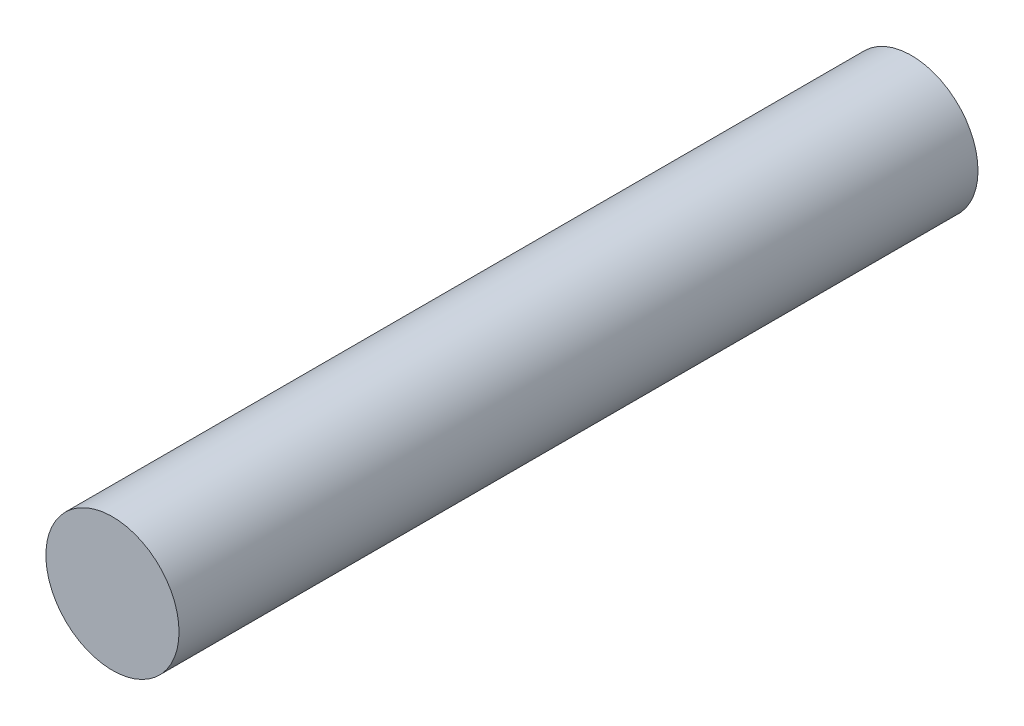
ISO-10303-21;
HEADER;
FILE_DESCRIPTION(('STEP AP214'),'2;1');
FILE_NAME('part.step','',(''),(''),'','','');
FILE_SCHEMA(('AUTOMOTIVE_DESIGN { 1 0 10303 214 1 1 1 1 }'));
ENDSEC;
DATA;
#1=APPLICATION_CONTEXT('core data for automotive mechanical design processes');
#2=APPLICATION_PROTOCOL_DEFINITION('international standard','automotive_design',2000,#1);
#3=PRODUCT_CONTEXT('',#1,'mechanical');
#4=PRODUCT('Part','Part','',(#3));
#5=PRODUCT_RELATED_PRODUCT_CATEGORY('part','',(#4));
#6=PRODUCT_DEFINITION_FORMATION('','',#4);
#7=PRODUCT_DEFINITION_CONTEXT('part definition',#1,'design');
#8=PRODUCT_DEFINITION('design','',#6,#7);
#9=PRODUCT_DEFINITION_SHAPE('','',#8);
#10=(LENGTH_UNIT() NAMED_UNIT(*) SI_UNIT(.MILLI.,.METRE.));
#11=(NAMED_UNIT(*) PLANE_ANGLE_UNIT() SI_UNIT($,.RADIAN.));
#12=(NAMED_UNIT(*) SI_UNIT($,.STERADIAN.) SOLID_ANGLE_UNIT());
#13=UNCERTAINTY_MEASURE_WITH_UNIT(LENGTH_MEASURE(1.E-05),#10,'distance_accuracy_value','');
#14=(GEOMETRIC_REPRESENTATION_CONTEXT(3) GLOBAL_UNCERTAINTY_ASSIGNED_CONTEXT((#13)) GLOBAL_UNIT_ASSIGNED_CONTEXT((#10,
#11,#12)) REPRESENTATION_CONTEXT('',''));
#15=CARTESIAN_POINT('',(0.,0.,0.));
#16=DIRECTION('',(0.,0.,1.));
#17=DIRECTION('',(1.,0.,0.));
#18=AXIS2_PLACEMENT_3D('',#15,#16,#17);
#19=CARTESIAN_POINT('',(0.,0.,-57.15));
#20=DIRECTION('',(0.,0.,1.));
#21=DIRECTION('',(1.,0.,0.));
#22=AXIS2_PLACEMENT_3D('',#19,#20,#21);
#23=CYLINDRICAL_SURFACE('',#22,4.7625);
#24=CARTESIAN_POINT('',(0.,0.,-57.15));
#25=DIRECTION('',(0.,0.,1.));
#26=DIRECTION('',(1.,0.,0.));
#27=AXIS2_PLACEMENT_3D('',#24,#25,#26);
#28=CIRCLE('',#27,4.7625);
#29=CARTESIAN_POINT('',(4.7625,0.,-57.15));
#30=VERTEX_POINT('',#29);
#31=EDGE_CURVE('E10',#30,#30,#28,.T.);
#32=ORIENTED_EDGE('',*,*,#31,.T.);
#33=EDGE_LOOP('',(#32));
#34=FACE_BOUND('',#33,.T.);
#35=CARTESIAN_POINT('',(0.,0.,0.));
#36=DIRECTION('',(0.,0.,1.));
#37=DIRECTION('',(1.,0.,0.));
#38=AXIS2_PLACEMENT_3D('',#35,#36,#37);
#39=CIRCLE('',#38,4.7625);
#40=CARTESIAN_POINT('',(4.7625,0.,0.));
#41=VERTEX_POINT('',#40);
#42=EDGE_CURVE('E43',#41,#41,#39,.T.);
#43=ORIENTED_EDGE('',*,*,#42,.F.);
#44=EDGE_LOOP('',(#43));
#45=FACE_BOUND('',#44,.T.);
#46=ADVANCED_FACE('F40',(#34,#45),#23,.T.);
#47=CARTESIAN_POINT('',(0.,0.,-57.15));
#48=DIRECTION('',(0.,0.,1.));
#49=DIRECTION('',(1.,0.,0.));
#50=AXIS2_PLACEMENT_3D('',#47,#48,#49);
#51=PLANE('',#50);
#52=ORIENTED_EDGE('',*,*,#31,.F.);
#53=EDGE_LOOP('',(#52));
#54=FACE_BOUND('',#53,.T.);
#55=ADVANCED_FACE('F57',(#54),#51,.F.);
#56=CARTESIAN_POINT('',(0.,0.,0.));
#57=DIRECTION('',(0.,0.,1.));
#58=DIRECTION('',(1.,0.,0.));
#59=AXIS2_PLACEMENT_3D('',#56,#57,#58);
#60=PLANE('',#59);
#61=ORIENTED_EDGE('',*,*,#42,.T.);
#62=EDGE_LOOP('',(#61));
#63=FACE_BOUND('',#62,.T.);
#64=ADVANCED_FACE('F54',(#63),#60,.T.);
#65=CLOSED_SHELL('',(#46,#55,#64));
#66=MANIFOLD_SOLID_BREP('B2',#65);
#67=ADVANCED_BREP_SHAPE_REPRESENTATION('',(#18,#66),#14);
#68=SHAPE_DEFINITION_REPRESENTATION(#9,#67);
ENDSEC;
END-ISO-10303-21;
